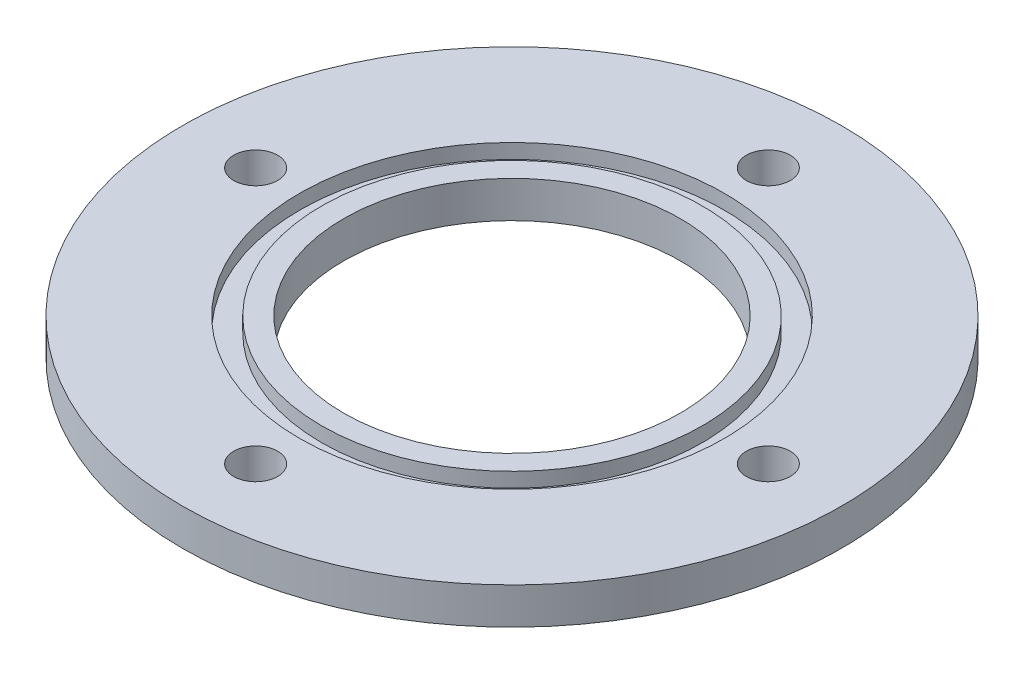
ISO-10303-21;
HEADER;
FILE_DESCRIPTION(('STEP AP214'),'2;1');
FILE_NAME('part.step','',(''),(''),'','','');
FILE_SCHEMA(('AUTOMOTIVE_DESIGN { 1 0 10303 214 1 1 1 1 }'));
ENDSEC;
DATA;
#1=APPLICATION_CONTEXT('core data for automotive mechanical design processes');
#2=APPLICATION_PROTOCOL_DEFINITION('international standard','automotive_design',2000,#1);
#3=PRODUCT_CONTEXT('',#1,'mechanical');
#4=PRODUCT('Part','Part','',(#3));
#5=PRODUCT_RELATED_PRODUCT_CATEGORY('part','',(#4));
#6=PRODUCT_DEFINITION_FORMATION('','',#4);
#7=PRODUCT_DEFINITION_CONTEXT('part definition',#1,'design');
#8=PRODUCT_DEFINITION('design','',#6,#7);
#9=PRODUCT_DEFINITION_SHAPE('','',#8);
#10=(LENGTH_UNIT() NAMED_UNIT(*) SI_UNIT(.MILLI.,.METRE.));
#11=(NAMED_UNIT(*) PLANE_ANGLE_UNIT() SI_UNIT($,.RADIAN.));
#12=(NAMED_UNIT(*) SI_UNIT($,.STERADIAN.) SOLID_ANGLE_UNIT());
#13=UNCERTAINTY_MEASURE_WITH_UNIT(LENGTH_MEASURE(1.E-05),#10,'distance_accuracy_value','');
#14=(GEOMETRIC_REPRESENTATION_CONTEXT(3) GLOBAL_UNCERTAINTY_ASSIGNED_CONTEXT((#13)) GLOBAL_UNIT_ASSIGNED_CONTEXT((#10,
#11,#12)) REPRESENTATION_CONTEXT('',''));
#15=CARTESIAN_POINT('',(0.,0.,0.));
#16=DIRECTION('',(0.,0.,1.));
#17=DIRECTION('',(1.,0.,0.));
#18=AXIS2_PLACEMENT_3D('',#15,#16,#17);
#19=CARTESIAN_POINT('',(0.,5.,0.));
#20=DIRECTION('',(0.,1.,0.));
#21=DIRECTION('',(0.,0.,1.));
#22=AXIS2_PLACEMENT_3D('',#19,#20,#21);
#23=PLANE('',#22);
#24=CARTESIAN_POINT('',(0.,5.,0.));
#25=DIRECTION('',(0.,1.,0.));
#26=DIRECTION('',(0.,0.,1.));
#27=AXIS2_PLACEMENT_3D('',#24,#25,#26);
#28=CIRCLE('',#27,23.);
#29=CARTESIAN_POINT('',(0.,5.,23.));
#30=VERTEX_POINT('',#29);
#31=EDGE_CURVE('E43',#30,#30,#28,.T.);
#32=ORIENTED_EDGE('',*,*,#31,.F.);
#33=EDGE_LOOP('',(#32));
#34=FACE_BOUND('',#33,.T.);
#35=CARTESIAN_POINT('',(0.,5.,0.));
#36=DIRECTION('',(0.,1.,0.));
#37=DIRECTION('',(0.,0.,1.));
#38=AXIS2_PLACEMENT_3D('',#35,#36,#37);
#39=CIRCLE('',#38,26.);
#40=CARTESIAN_POINT('',(0.,5.,26.));
#41=VERTEX_POINT('',#40);
#42=EDGE_CURVE('E123',#41,#41,#39,.T.);
#43=ORIENTED_EDGE('',*,*,#42,.T.);
#44=EDGE_LOOP('',(#43));
#45=FACE_BOUND('',#44,.T.);
#46=ADVANCED_FACE('F35',(#34,#45),#23,.T.);
#47=CARTESIAN_POINT('',(0.,5.,0.));
#48=DIRECTION('',(0.,-1.,0.));
#49=DIRECTION('',(0.,0.,-1.));
#50=AXIS2_PLACEMENT_3D('',#47,#48,#49);
#51=CYLINDRICAL_SURFACE('',#50,23.);
#52=ORIENTED_EDGE('',*,*,#31,.T.);
#53=EDGE_LOOP('',(#52));
#54=FACE_BOUND('',#53,.T.);
#55=CARTESIAN_POINT('',(0.,0.,0.));
#56=DIRECTION('',(0.,1.,0.));
#57=DIRECTION('',(0.,0.,1.));
#58=AXIS2_PLACEMENT_3D('',#55,#56,#57);
#59=CIRCLE('',#58,23.);
#60=CARTESIAN_POINT('',(0.,0.,23.));
#61=VERTEX_POINT('',#60);
#62=EDGE_CURVE('E64',#61,#61,#59,.T.);
#63=ORIENTED_EDGE('',*,*,#62,.F.);
#64=EDGE_LOOP('',(#63));
#65=FACE_BOUND('',#64,.T.);
#66=ADVANCED_FACE('F111',(#54,#65),#51,.F.);
#67=CARTESIAN_POINT('',(0.,5.,-35.));
#68=DIRECTION('',(0.,-1.,0.));
#69=DIRECTION('',(0.,0.,-1.));
#70=AXIS2_PLACEMENT_3D('',#67,#68,#69);
#71=CYLINDRICAL_SURFACE('',#70,3.);
#72=CARTESIAN_POINT('',(0.,5.,-35.));
#73=DIRECTION('',(0.,1.,0.));
#74=DIRECTION('',(0.,0.,1.));
#75=AXIS2_PLACEMENT_3D('',#72,#73,#74);
#76=CIRCLE('',#75,3.);
#77=CARTESIAN_POINT('',(0.,5.,-32.));
#78=VERTEX_POINT('',#77);
#79=EDGE_CURVE('E48',#78,#78,#76,.T.);
#80=ORIENTED_EDGE('',*,*,#79,.T.);
#81=EDGE_LOOP('',(#80));
#82=FACE_BOUND('',#81,.T.);
#83=CARTESIAN_POINT('',(0.,0.,-35.));
#84=DIRECTION('',(0.,1.,0.));
#85=DIRECTION('',(0.,0.,1.));
#86=AXIS2_PLACEMENT_3D('',#83,#84,#85);
#87=CIRCLE('',#86,3.);
#88=CARTESIAN_POINT('',(0.,0.,-32.));
#89=VERTEX_POINT('',#88);
#90=EDGE_CURVE('E62',#89,#89,#87,.T.);
#91=ORIENTED_EDGE('',*,*,#90,.F.);
#92=EDGE_LOOP('',(#91));
#93=FACE_BOUND('',#92,.T.);
#94=ADVANCED_FACE('F88',(#82,#93),#71,.F.);
#95=CARTESIAN_POINT('',(0.,5.,35.));
#96=DIRECTION('',(0.,-1.,0.));
#97=DIRECTION('',(0.,0.,-1.));
#98=AXIS2_PLACEMENT_3D('',#95,#96,#97);
#99=CYLINDRICAL_SURFACE('',#98,3.);
#100=CARTESIAN_POINT('',(0.,5.,35.));
#101=DIRECTION('',(0.,1.,0.));
#102=DIRECTION('',(0.,0.,1.));
#103=AXIS2_PLACEMENT_3D('',#100,#101,#102);
#104=CIRCLE('',#103,3.);
#105=CARTESIAN_POINT('',(0.,5.,38.));
#106=VERTEX_POINT('',#105);
#107=EDGE_CURVE('E78',#106,#106,#104,.T.);
#108=ORIENTED_EDGE('',*,*,#107,.T.);
#109=EDGE_LOOP('',(#108));
#110=FACE_BOUND('',#109,.T.);
#111=CARTESIAN_POINT('',(0.,0.,35.));
#112=DIRECTION('',(0.,1.,0.));
#113=DIRECTION('',(0.,0.,1.));
#114=AXIS2_PLACEMENT_3D('',#111,#112,#113);
#115=CIRCLE('',#114,3.);
#116=CARTESIAN_POINT('',(0.,0.,38.));
#117=VERTEX_POINT('',#116);
#118=EDGE_CURVE('E59',#117,#117,#115,.T.);
#119=ORIENTED_EDGE('',*,*,#118,.F.);
#120=EDGE_LOOP('',(#119));
#121=FACE_BOUND('',#120,.T.);
#122=ADVANCED_FACE('F190',(#110,#121),#99,.F.);
#123=CARTESIAN_POINT('',(35.,5.,0.));
#124=DIRECTION('',(0.,-1.,0.));
#125=DIRECTION('',(0.,0.,-1.));
#126=AXIS2_PLACEMENT_3D('',#123,#124,#125);
#127=CYLINDRICAL_SURFACE('',#126,3.);
#128=CARTESIAN_POINT('',(35.,5.,0.));
#129=DIRECTION('',(0.,1.,0.));
#130=DIRECTION('',(0.,0.,1.));
#131=AXIS2_PLACEMENT_3D('',#128,#129,#130);
#132=CIRCLE('',#131,3.);
#133=CARTESIAN_POINT('',(35.,5.,3.));
#134=VERTEX_POINT('',#133);
#135=EDGE_CURVE('E73',#134,#134,#132,.T.);
#136=ORIENTED_EDGE('',*,*,#135,.T.);
#137=EDGE_LOOP('',(#136));
#138=FACE_BOUND('',#137,.T.);
#139=CARTESIAN_POINT('',(35.,0.,0.));
#140=DIRECTION('',(0.,1.,0.));
#141=DIRECTION('',(0.,0.,1.));
#142=AXIS2_PLACEMENT_3D('',#139,#140,#141);
#143=CIRCLE('',#142,3.);
#144=CARTESIAN_POINT('',(35.,0.,3.));
#145=VERTEX_POINT('',#144);
#146=EDGE_CURVE('E55',#145,#145,#143,.T.);
#147=ORIENTED_EDGE('',*,*,#146,.F.);
#148=EDGE_LOOP('',(#147));
#149=FACE_BOUND('',#148,.T.);
#150=ADVANCED_FACE('F183',(#138,#149),#127,.F.);
#151=CARTESIAN_POINT('',(-35.,5.,0.));
#152=DIRECTION('',(0.,-1.,0.));
#153=DIRECTION('',(0.,0.,-1.));
#154=AXIS2_PLACEMENT_3D('',#151,#152,#153);
#155=CYLINDRICAL_SURFACE('',#154,3.);
#156=CARTESIAN_POINT('',(-35.,5.,0.));
#157=DIRECTION('',(0.,1.,0.));
#158=DIRECTION('',(0.,0.,1.));
#159=AXIS2_PLACEMENT_3D('',#156,#157,#158);
#160=CIRCLE('',#159,3.);
#161=CARTESIAN_POINT('',(-35.,5.,3.00000000000002));
#162=VERTEX_POINT('',#161);
#163=EDGE_CURVE('E69',#162,#162,#160,.T.);
#164=ORIENTED_EDGE('',*,*,#163,.T.);
#165=EDGE_LOOP('',(#164));
#166=FACE_BOUND('',#165,.T.);
#167=CARTESIAN_POINT('',(-35.,0.,0.));
#168=DIRECTION('',(0.,1.,0.));
#169=DIRECTION('',(0.,0.,1.));
#170=AXIS2_PLACEMENT_3D('',#167,#168,#169);
#171=CIRCLE('',#170,3.);
#172=CARTESIAN_POINT('',(-35.,0.,3.00000000000002));
#173=VERTEX_POINT('',#172);
#174=EDGE_CURVE('E52',#173,#173,#171,.T.);
#175=ORIENTED_EDGE('',*,*,#174,.F.);
#176=EDGE_LOOP('',(#175));
#177=FACE_BOUND('',#176,.T.);
#178=ADVANCED_FACE('F37',(#166,#177),#155,.F.);
#179=CARTESIAN_POINT('',(0.,5.,0.));
#180=DIRECTION('',(0.,-1.,0.));
#181=DIRECTION('',(0.,0.,-1.));
#182=AXIS2_PLACEMENT_3D('',#179,#180,#181);
#183=CYLINDRICAL_SURFACE('',#182,45.);
#184=CARTESIAN_POINT('',(0.,5.,0.));
#185=DIRECTION('',(0.,1.,0.));
#186=DIRECTION('',(0.,0.,1.));
#187=AXIS2_PLACEMENT_3D('',#184,#185,#186);
#188=CIRCLE('',#187,45.);
#189=CARTESIAN_POINT('',(0.,5.,45.));
#190=VERTEX_POINT('',#189);
#191=EDGE_CURVE('E10',#190,#190,#188,.T.);
#192=ORIENTED_EDGE('',*,*,#191,.F.);
#193=EDGE_LOOP('',(#192));
#194=FACE_BOUND('',#193,.T.);
#195=CARTESIAN_POINT('',(0.,0.,0.));
#196=DIRECTION('',(0.,1.,0.));
#197=DIRECTION('',(0.,0.,1.));
#198=AXIS2_PLACEMENT_3D('',#195,#196,#197);
#199=CIRCLE('',#198,45.);
#200=CARTESIAN_POINT('',(0.,0.,45.));
#201=VERTEX_POINT('',#200);
#202=EDGE_CURVE('E39',#201,#201,#199,.T.);
#203=ORIENTED_EDGE('',*,*,#202,.T.);
#204=EDGE_LOOP('',(#203));
#205=FACE_BOUND('',#204,.T.);
#206=ADVANCED_FACE('F94',(#194,#205),#183,.T.);
#207=CARTESIAN_POINT('',(0.,5.,0.));
#208=DIRECTION('',(0.,1.,0.));
#209=DIRECTION('',(0.,0.,1.));
#210=AXIS2_PLACEMENT_3D('',#207,#208,#209);
#211=CIRCLE('',#210,29.);
#212=CARTESIAN_POINT('',(0.,5.,29.));
#213=VERTEX_POINT('',#212);
#214=EDGE_CURVE('E81',#213,#213,#211,.T.);
#215=ORIENTED_EDGE('',*,*,#214,.F.);
#216=EDGE_LOOP('',(#215));
#217=FACE_BOUND('',#216,.T.);
#218=ORIENTED_EDGE('',*,*,#163,.F.);
#219=EDGE_LOOP('',(#218));
#220=FACE_BOUND('',#219,.T.);
#221=ORIENTED_EDGE('',*,*,#135,.F.);
#222=EDGE_LOOP('',(#221));
#223=FACE_BOUND('',#222,.T.);
#224=ORIENTED_EDGE('',*,*,#107,.F.);
#225=EDGE_LOOP('',(#224));
#226=FACE_BOUND('',#225,.T.);
#227=ORIENTED_EDGE('',*,*,#79,.F.);
#228=EDGE_LOOP('',(#227));
#229=FACE_BOUND('',#228,.T.);
#230=ORIENTED_EDGE('',*,*,#191,.T.);
#231=EDGE_LOOP('',(#230));
#232=FACE_BOUND('',#231,.T.);
#233=ADVANCED_FACE('F91',(#217,#220,#223,#226,#229,#232),#23,.T.);
#234=CARTESIAN_POINT('',(0.,0.,0.));
#235=DIRECTION('',(0.,1.,0.));
#236=DIRECTION('',(0.,0.,1.));
#237=AXIS2_PLACEMENT_3D('',#234,#235,#236);
#238=PLANE('',#237);
#239=ORIENTED_EDGE('',*,*,#174,.T.);
#240=EDGE_LOOP('',(#239));
#241=FACE_BOUND('',#240,.T.);
#242=ORIENTED_EDGE('',*,*,#146,.T.);
#243=EDGE_LOOP('',(#242));
#244=FACE_BOUND('',#243,.T.);
#245=ORIENTED_EDGE('',*,*,#118,.T.);
#246=EDGE_LOOP('',(#245));
#247=FACE_BOUND('',#246,.T.);
#248=ORIENTED_EDGE('',*,*,#90,.T.);
#249=EDGE_LOOP('',(#248));
#250=FACE_BOUND('',#249,.T.);
#251=ORIENTED_EDGE('',*,*,#62,.T.);
#252=EDGE_LOOP('',(#251));
#253=FACE_BOUND('',#252,.T.);
#254=ORIENTED_EDGE('',*,*,#202,.F.);
#255=EDGE_LOOP('',(#254));
#256=FACE_BOUND('',#255,.T.);
#257=ADVANCED_FACE('F93',(#241,#244,#247,#250,#253,#256),#238,.F.);
#258=CARTESIAN_POINT('',(0.,3.,0.));
#259=DIRECTION('',(0.,1.,0.));
#260=DIRECTION('',(0.,0.,1.));
#261=AXIS2_PLACEMENT_3D('',#258,#259,#260);
#262=CYLINDRICAL_SURFACE('',#261,29.);
#263=CARTESIAN_POINT('',(0.,3.,0.));
#264=DIRECTION('',(0.,1.,0.));
#265=DIRECTION('',(0.,0.,1.));
#266=AXIS2_PLACEMENT_3D('',#263,#264,#265);
#267=CIRCLE('',#266,29.);
#268=CARTESIAN_POINT('',(0.,3.,29.));
#269=VERTEX_POINT('',#268);
#270=EDGE_CURVE('E56',#269,#269,#267,.T.);
#271=ORIENTED_EDGE('',*,*,#270,.F.);
#272=EDGE_LOOP('',(#271));
#273=FACE_BOUND('',#272,.T.);
#274=ORIENTED_EDGE('',*,*,#214,.T.);
#275=EDGE_LOOP('',(#274));
#276=FACE_BOUND('',#275,.T.);
#277=ADVANCED_FACE('F102',(#273,#276),#262,.F.);
#278=CARTESIAN_POINT('',(0.,3.,0.));
#279=DIRECTION('',(0.,1.,0.));
#280=DIRECTION('',(0.,0.,1.));
#281=AXIS2_PLACEMENT_3D('',#278,#279,#280);
#282=PLANE('',#281);
#283=CARTESIAN_POINT('',(0.,3.,0.));
#284=DIRECTION('',(0.,1.,0.));
#285=DIRECTION('',(0.,0.,1.));
#286=AXIS2_PLACEMENT_3D('',#283,#284,#285);
#287=CIRCLE('',#286,26.);
#288=CARTESIAN_POINT('',(0.,3.,26.));
#289=VERTEX_POINT('',#288);
#290=EDGE_CURVE('E125',#289,#289,#287,.T.);
#291=ORIENTED_EDGE('',*,*,#290,.F.);
#292=EDGE_LOOP('',(#291));
#293=FACE_BOUND('',#292,.T.);
#294=ORIENTED_EDGE('',*,*,#270,.T.);
#295=EDGE_LOOP('',(#294));
#296=FACE_BOUND('',#295,.T.);
#297=ADVANCED_FACE('F135',(#293,#296),#282,.T.);
#298=CARTESIAN_POINT('',(0.,3.,0.));
#299=DIRECTION('',(0.,1.,0.));
#300=DIRECTION('',(0.,0.,1.));
#301=AXIS2_PLACEMENT_3D('',#298,#299,#300);
#302=CYLINDRICAL_SURFACE('',#301,26.);
#303=ORIENTED_EDGE('',*,*,#290,.T.);
#304=EDGE_LOOP('',(#303));
#305=FACE_BOUND('',#304,.T.);
#306=ORIENTED_EDGE('',*,*,#42,.F.);
#307=EDGE_LOOP('',(#306));
#308=FACE_BOUND('',#307,.T.);
#309=ADVANCED_FACE('F140',(#305,#308),#302,.T.);
#310=CLOSED_SHELL('',(#46,#66,#94,#122,#150,#178,#206,#233,#257,#277,#297,#309));
#311=MANIFOLD_SOLID_BREP('B2',#310);
#312=ADVANCED_BREP_SHAPE_REPRESENTATION('',(#18,#311),#14);
#313=SHAPE_DEFINITION_REPRESENTATION(#9,#312);
ENDSEC;
END-ISO-10303-21;
